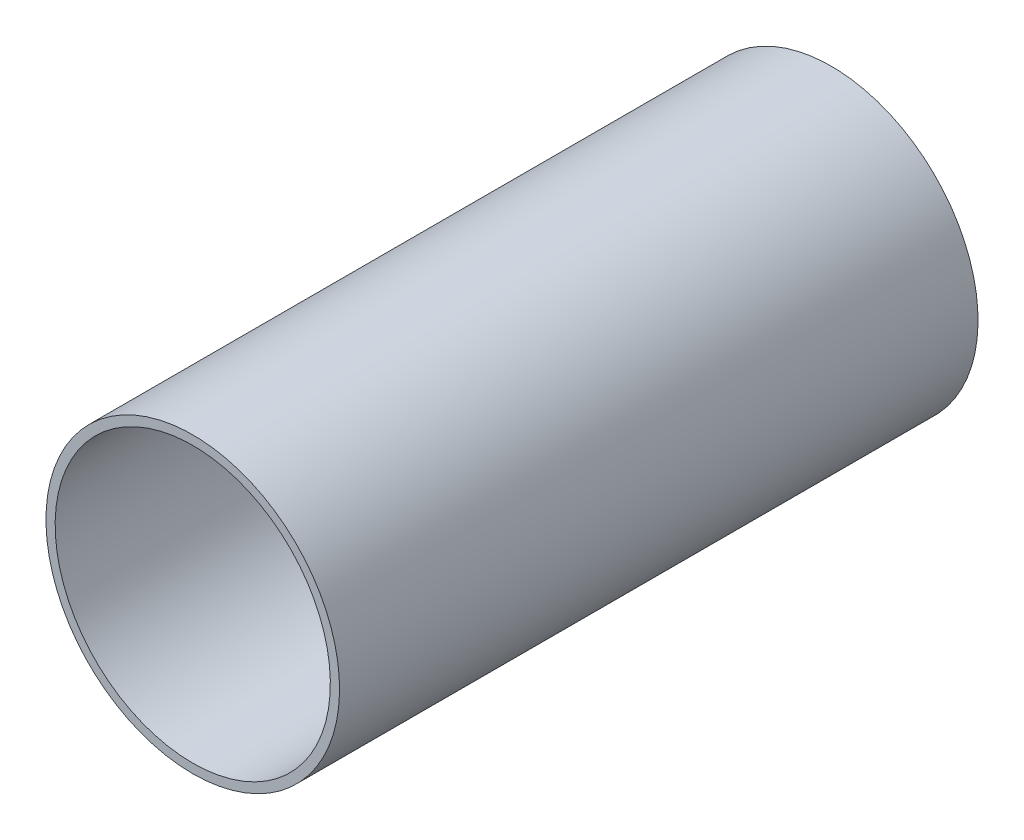
ISO-10303-21;
HEADER;
FILE_DESCRIPTION(('STEP AP214'),'2;1');
FILE_NAME('part.step','',(''),(''),'','','');
FILE_SCHEMA(('AUTOMOTIVE_DESIGN { 1 0 10303 214 1 1 1 1 }'));
ENDSEC;
DATA;
#1=APPLICATION_CONTEXT('core data for automotive mechanical design processes');
#2=APPLICATION_PROTOCOL_DEFINITION('international standard','automotive_design',2000,#1);
#3=PRODUCT_CONTEXT('',#1,'mechanical');
#4=PRODUCT('Part','Part','',(#3));
#5=PRODUCT_RELATED_PRODUCT_CATEGORY('part','',(#4));
#6=PRODUCT_DEFINITION_FORMATION('','',#4);
#7=PRODUCT_DEFINITION_CONTEXT('part definition',#1,'design');
#8=PRODUCT_DEFINITION('design','',#6,#7);
#9=PRODUCT_DEFINITION_SHAPE('','',#8);
#10=(LENGTH_UNIT() NAMED_UNIT(*) SI_UNIT(.MILLI.,.METRE.));
#11=(NAMED_UNIT(*) PLANE_ANGLE_UNIT() SI_UNIT($,.RADIAN.));
#12=(NAMED_UNIT(*) SI_UNIT($,.STERADIAN.) SOLID_ANGLE_UNIT());
#13=UNCERTAINTY_MEASURE_WITH_UNIT(LENGTH_MEASURE(1.E-05),#10,'distance_accuracy_value','');
#14=(GEOMETRIC_REPRESENTATION_CONTEXT(3) GLOBAL_UNCERTAINTY_ASSIGNED_CONTEXT((#13)) GLOBAL_UNIT_ASSIGNED_CONTEXT((#10,
#11,#12)) REPRESENTATION_CONTEXT('',''));
#15=CARTESIAN_POINT('',(0.,0.,0.));
#16=DIRECTION('',(0.,0.,1.));
#17=DIRECTION('',(1.,0.,0.));
#18=AXIS2_PLACEMENT_3D('',#15,#16,#17);
#19=CARTESIAN_POINT('',(170.307,-143.637,-0.045));
#20=DIRECTION('',(0.,0.,-1.));
#21=DIRECTION('',(0.,-1.,0.));
#22=AXIS2_PLACEMENT_3D('',#19,#20,#21);
#23=CYLINDRICAL_SURFACE('',#22,0.375);
#24=CARTESIAN_POINT('',(170.307,-143.637,-0.035));
#25=DIRECTION('',(0.,0.,-1.));
#26=DIRECTION('',(0.,-1.,0.));
#27=AXIS2_PLACEMENT_3D('',#24,#25,#26);
#28=CIRCLE('',#27,0.375);
#29=CARTESIAN_POINT('',(170.307,-144.012,-0.035));
#30=VERTEX_POINT('',#29);
#31=EDGE_CURVE('E64',#30,#30,#28,.T.);
#32=ORIENTED_EDGE('',*,*,#31,.T.);
#33=DIRECTION('',(0.,0.,1.));
#34=VECTOR('',#33,1.);
#35=CARTESIAN_POINT('',(170.307,-144.012,-0.045));
#36=LINE('',#35,#34);
#37=CARTESIAN_POINT('',(170.307,-144.012,1.705));
#38=VERTEX_POINT('',#37);
#39=EDGE_CURVE('E11',#30,#38,#36,.T.);
#40=ORIENTED_EDGE('',*,*,#39,.T.);
#41=CARTESIAN_POINT('',(170.307,-143.637,1.705));
#42=DIRECTION('',(0.,0.,-1.));
#43=DIRECTION('',(0.,-1.,0.));
#44=AXIS2_PLACEMENT_3D('',#41,#42,#43);
#45=CIRCLE('',#44,0.375);
#46=EDGE_CURVE('E25',#38,#38,#45,.T.);
#47=ORIENTED_EDGE('',*,*,#46,.F.);
#48=ORIENTED_EDGE('',*,*,#39,.F.);
#49=EDGE_LOOP('',(#32,#40,#47,#48));
#50=FACE_BOUND('',#49,.T.);
#51=ADVANCED_FACE('F17',(#50),#23,.F.);
#52=CARTESIAN_POINT('',(170.307,-144.037,1.705));
#53=DIRECTION('',(0.,0.,1.));
#54=DIRECTION('',(1.,0.,0.));
#55=AXIS2_PLACEMENT_3D('',#52,#53,#54);
#56=PLANE('',#55);
#57=ORIENTED_EDGE('',*,*,#46,.T.);
#58=EDGE_LOOP('',(#57));
#59=FACE_BOUND('',#58,.T.);
#60=CARTESIAN_POINT('',(170.307,-143.637,1.705));
#61=DIRECTION('',(0.,0.,1.));
#62=DIRECTION('',(0.,-1.,0.));
#63=AXIS2_PLACEMENT_3D('',#60,#61,#62);
#64=CIRCLE('',#63,0.4);
#65=CARTESIAN_POINT('',(170.307,-144.037,1.705));
#66=VERTEX_POINT('',#65);
#67=EDGE_CURVE('E56',#66,#66,#64,.T.);
#68=ORIENTED_EDGE('',*,*,#67,.T.);
#69=EDGE_LOOP('',(#68));
#70=FACE_BOUND('',#69,.T.);
#71=ADVANCED_FACE('F73',(#59,#70),#56,.T.);
#72=CARTESIAN_POINT('',(170.307,-144.037,-0.035));
#73=DIRECTION('',(0.,0.,1.));
#74=DIRECTION('',(1.,0.,0.));
#75=AXIS2_PLACEMENT_3D('',#72,#73,#74);
#76=PLANE('',#75);
#77=ORIENTED_EDGE('',*,*,#31,.F.);
#78=EDGE_LOOP('',(#77));
#79=FACE_BOUND('',#78,.T.);
#80=CARTESIAN_POINT('',(170.307,-143.637,-0.035));
#81=DIRECTION('',(0.,0.,1.));
#82=DIRECTION('',(0.,-1.,0.));
#83=AXIS2_PLACEMENT_3D('',#80,#81,#82);
#84=CIRCLE('',#83,0.4);
#85=CARTESIAN_POINT('',(170.307,-144.037,-0.035));
#86=VERTEX_POINT('',#85);
#87=EDGE_CURVE('E55',#86,#86,#84,.T.);
#88=ORIENTED_EDGE('',*,*,#87,.F.);
#89=EDGE_LOOP('',(#88));
#90=FACE_BOUND('',#89,.T.);
#91=ADVANCED_FACE('F82',(#79,#90),#76,.F.);
#92=CARTESIAN_POINT('',(170.307,-143.637,-0.035));
#93=DIRECTION('',(0.,0.,-1.));
#94=DIRECTION('',(0.,-1.,0.));
#95=AXIS2_PLACEMENT_3D('',#92,#93,#94);
#96=CYLINDRICAL_SURFACE('',#95,0.4);
#97=ORIENTED_EDGE('',*,*,#87,.T.);
#98=DIRECTION('',(0.,0.,1.));
#99=VECTOR('',#98,1.);
#100=CARTESIAN_POINT('',(170.307,-144.037,-0.035));
#101=LINE('',#100,#99);
#102=EDGE_CURVE('E52',#86,#66,#101,.T.);
#103=ORIENTED_EDGE('',*,*,#102,.T.);
#104=ORIENTED_EDGE('',*,*,#67,.F.);
#105=ORIENTED_EDGE('',*,*,#102,.F.);
#106=EDGE_LOOP('',(#97,#103,#104,#105));
#107=FACE_BOUND('',#106,.T.);
#108=ADVANCED_FACE('F53',(#107),#96,.T.);
#109=CLOSED_SHELL('',(#51,#71,#91,#108));
#110=MANIFOLD_SOLID_BREP('B1',#109);
#111=ADVANCED_BREP_SHAPE_REPRESENTATION('',(#18,#110),#14);
#112=SHAPE_DEFINITION_REPRESENTATION(#9,#111);
ENDSEC;
END-ISO-10303-21;
